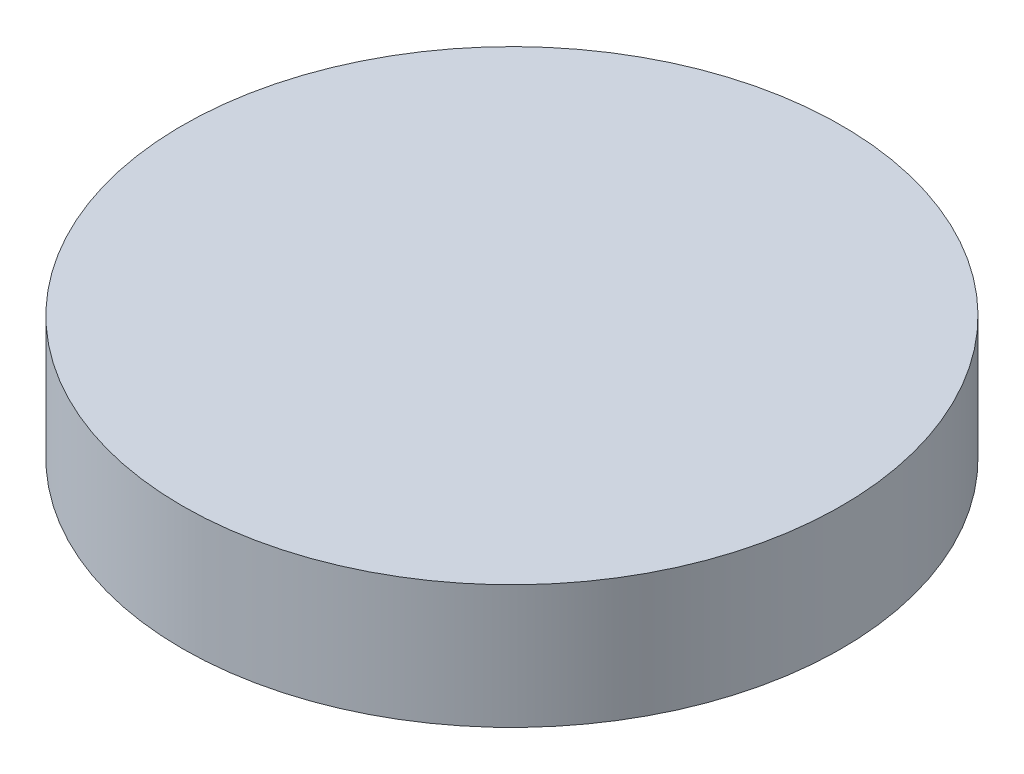
ISO-10303-21;
HEADER;
FILE_DESCRIPTION(('STEP AP214'),'2;1');
FILE_NAME('part.step','',(''),(''),'','','');
FILE_SCHEMA(('AUTOMOTIVE_DESIGN { 1 0 10303 214 1 1 1 1 }'));
ENDSEC;
DATA;
#1=APPLICATION_CONTEXT('core data for automotive mechanical design processes');
#2=APPLICATION_PROTOCOL_DEFINITION('international standard','automotive_design',2000,#1);
#3=PRODUCT_CONTEXT('',#1,'mechanical');
#4=PRODUCT('Part','Part','',(#3));
#5=PRODUCT_RELATED_PRODUCT_CATEGORY('part','',(#4));
#6=PRODUCT_DEFINITION_FORMATION('','',#4);
#7=PRODUCT_DEFINITION_CONTEXT('part definition',#1,'design');
#8=PRODUCT_DEFINITION('design','',#6,#7);
#9=PRODUCT_DEFINITION_SHAPE('','',#8);
#10=(LENGTH_UNIT() NAMED_UNIT(*) SI_UNIT(.MILLI.,.METRE.));
#11=(NAMED_UNIT(*) PLANE_ANGLE_UNIT() SI_UNIT($,.RADIAN.));
#12=(NAMED_UNIT(*) SI_UNIT($,.STERADIAN.) SOLID_ANGLE_UNIT());
#13=UNCERTAINTY_MEASURE_WITH_UNIT(LENGTH_MEASURE(1.E-05),#10,'distance_accuracy_value','');
#14=(GEOMETRIC_REPRESENTATION_CONTEXT(3) GLOBAL_UNCERTAINTY_ASSIGNED_CONTEXT((#13)) GLOBAL_UNIT_ASSIGNED_CONTEXT((#10,
#11,#12)) REPRESENTATION_CONTEXT('',''));
#15=CARTESIAN_POINT('',(0.,0.,0.));
#16=DIRECTION('',(0.,0.,1.));
#17=DIRECTION('',(1.,0.,0.));
#18=AXIS2_PLACEMENT_3D('',#15,#16,#17);
#19=CARTESIAN_POINT('',(0.,15.,0.));
#20=DIRECTION('',(0.,-1.,0.));
#21=DIRECTION('',(0.,0.,-1.));
#22=AXIS2_PLACEMENT_3D('',#19,#20,#21);
#23=CYLINDRICAL_SURFACE('',#22,40.);
#24=CARTESIAN_POINT('',(0.,15.,0.));
#25=DIRECTION('',(0.,1.,0.));
#26=DIRECTION('',(0.,0.,1.));
#27=AXIS2_PLACEMENT_3D('',#24,#25,#26);
#28=CIRCLE('',#27,40.);
#29=CARTESIAN_POINT('',(0.,15.,40.));
#30=VERTEX_POINT('',#29);
#31=EDGE_CURVE('E10',#30,#30,#28,.T.);
#32=ORIENTED_EDGE('',*,*,#31,.F.);
#33=EDGE_LOOP('',(#32));
#34=FACE_BOUND('',#33,.T.);
#35=CARTESIAN_POINT('',(0.,0.,0.));
#36=DIRECTION('',(0.,1.,0.));
#37=DIRECTION('',(0.,0.,1.));
#38=AXIS2_PLACEMENT_3D('',#35,#36,#37);
#39=CIRCLE('',#38,40.);
#40=CARTESIAN_POINT('',(0.,0.,40.));
#41=VERTEX_POINT('',#40);
#42=EDGE_CURVE('E34',#41,#41,#39,.T.);
#43=ORIENTED_EDGE('',*,*,#42,.T.);
#44=EDGE_LOOP('',(#43));
#45=FACE_BOUND('',#44,.T.);
#46=ADVANCED_FACE('F31',(#34,#45),#23,.T.);
#47=CARTESIAN_POINT('',(0.,15.,0.));
#48=DIRECTION('',(0.,1.,0.));
#49=DIRECTION('',(0.,0.,1.));
#50=AXIS2_PLACEMENT_3D('',#47,#48,#49);
#51=PLANE('',#50);
#52=ORIENTED_EDGE('',*,*,#31,.T.);
#53=EDGE_LOOP('',(#52));
#54=FACE_BOUND('',#53,.T.);
#55=ADVANCED_FACE('F46',(#54),#51,.T.);
#56=CARTESIAN_POINT('',(0.,0.,0.));
#57=DIRECTION('',(0.,1.,0.));
#58=DIRECTION('',(0.,0.,1.));
#59=AXIS2_PLACEMENT_3D('',#56,#57,#58);
#60=PLANE('',#59);
#61=ORIENTED_EDGE('',*,*,#42,.F.);
#62=EDGE_LOOP('',(#61));
#63=FACE_BOUND('',#62,.T.);
#64=ADVANCED_FACE('F44',(#63),#60,.F.);
#65=CLOSED_SHELL('',(#46,#55,#64));
#66=MANIFOLD_SOLID_BREP('B2',#65);
#67=ADVANCED_BREP_SHAPE_REPRESENTATION('',(#18,#66),#14);
#68=SHAPE_DEFINITION_REPRESENTATION(#9,#67);
ENDSEC;
END-ISO-10303-21;
